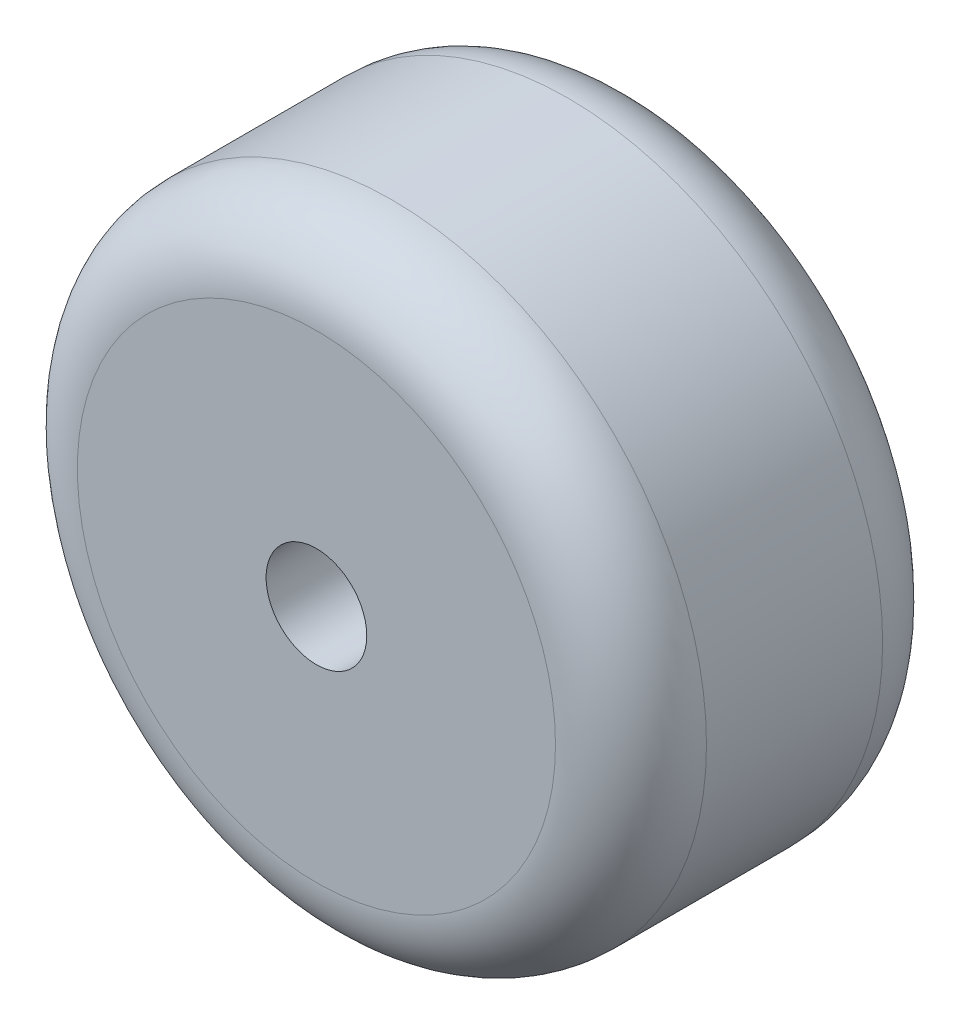
ISO-10303-21;
HEADER;
FILE_DESCRIPTION(('STEP AP214'),'2;1');
FILE_NAME('part.step','',(''),(''),'','','');
FILE_SCHEMA(('AUTOMOTIVE_DESIGN { 1 0 10303 214 1 1 1 1 }'));
ENDSEC;
DATA;
#1=APPLICATION_CONTEXT('core data for automotive mechanical design processes');
#2=APPLICATION_PROTOCOL_DEFINITION('international standard','automotive_design',2000,#1);
#3=PRODUCT_CONTEXT('',#1,'mechanical');
#4=PRODUCT('Part','Part','',(#3));
#5=PRODUCT_RELATED_PRODUCT_CATEGORY('part','',(#4));
#6=PRODUCT_DEFINITION_FORMATION('','',#4);
#7=PRODUCT_DEFINITION_CONTEXT('part definition',#1,'design');
#8=PRODUCT_DEFINITION('design','',#6,#7);
#9=PRODUCT_DEFINITION_SHAPE('','',#8);
#10=(LENGTH_UNIT() NAMED_UNIT(*) SI_UNIT(.MILLI.,.METRE.));
#11=(NAMED_UNIT(*) PLANE_ANGLE_UNIT() SI_UNIT($,.RADIAN.));
#12=(NAMED_UNIT(*) SI_UNIT($,.STERADIAN.) SOLID_ANGLE_UNIT());
#13=UNCERTAINTY_MEASURE_WITH_UNIT(LENGTH_MEASURE(1.E-05),#10,'distance_accuracy_value','');
#14=(GEOMETRIC_REPRESENTATION_CONTEXT(3) GLOBAL_UNCERTAINTY_ASSIGNED_CONTEXT((#13)) GLOBAL_UNIT_ASSIGNED_CONTEXT((#10,
#11,#12)) REPRESENTATION_CONTEXT('',''));
#15=CARTESIAN_POINT('',(0.,0.,0.));
#16=DIRECTION('',(0.,0.,1.));
#17=DIRECTION('',(1.,0.,0.));
#18=AXIS2_PLACEMENT_3D('',#15,#16,#17);
#19=CARTESIAN_POINT('',(0.,0.,6.50000000000001));
#20=DIRECTION('',(0.,0.,1.));
#21=DIRECTION('',(1.,0.,0.));
#22=AXIS2_PLACEMENT_3D('',#19,#20,#21);
#23=PLANE('',#22);
#24=CARTESIAN_POINT('',(0.,0.,6.50000000000001));
#25=DIRECTION('',(0.,0.,1.));
#26=DIRECTION('',(1.,0.,0.));
#27=AXIS2_PLACEMENT_3D('',#24,#25,#26);
#28=CIRCLE('',#27,2.);
#29=CARTESIAN_POINT('',(2.,0.,6.50000000000001));
#30=VERTEX_POINT('',#29);
#31=EDGE_CURVE('E50',#30,#30,#28,.T.);
#32=ORIENTED_EDGE('',*,*,#31,.F.);
#33=EDGE_LOOP('',(#32));
#34=FACE_BOUND('',#33,.T.);
#35=CARTESIAN_POINT('',(0.,0.,6.50000000000001));
#36=DIRECTION('',(0.,0.,1.));
#37=DIRECTION('',(1.,0.,0.));
#38=AXIS2_PLACEMENT_3D('',#35,#36,#37);
#39=CIRCLE('',#38,9.49999999999998);
#40=CARTESIAN_POINT('',(9.49999999999998,0.,6.50000000000001));
#41=VERTEX_POINT('',#40);
#42=EDGE_CURVE('E10',#41,#41,#39,.T.);
#43=ORIENTED_EDGE('',*,*,#42,.T.);
#44=EDGE_LOOP('',(#43));
#45=FACE_BOUND('',#44,.T.);
#46=ADVANCED_FACE('F31',(#34,#45),#23,.T.);
#47=CARTESIAN_POINT('',(0.,0.,3.50000000000001));
#48=DIRECTION('',(0.,0.,1.));
#49=DIRECTION('',(1.,0.,0.));
#50=AXIS2_PLACEMENT_3D('',#47,#48,#49);
#51=TOROIDAL_SURFACE('',#50,9.5,3.);
#52=CARTESIAN_POINT('',(0.,0.,3.49999999999998));
#53=DIRECTION('',(0.,0.,1.));
#54=DIRECTION('',(1.,0.,0.));
#55=AXIS2_PLACEMENT_3D('',#52,#53,#54);
#56=CIRCLE('',#55,12.5);
#57=CARTESIAN_POINT('',(12.5,0.,3.49999999999998));
#58=VERTEX_POINT('',#57);
#59=EDGE_CURVE('E37',#58,#58,#56,.T.);
#60=ORIENTED_EDGE('',*,*,#59,.T.);
#61=EDGE_LOOP('',(#60));
#62=FACE_BOUND('',#61,.T.);
#63=ORIENTED_EDGE('',*,*,#42,.F.);
#64=EDGE_LOOP('',(#63));
#65=FACE_BOUND('',#64,.T.);
#66=ADVANCED_FACE('F70',(#62,#65),#51,.T.);
#67=CARTESIAN_POINT('',(0.,0.,6.50000000000001));
#68=DIRECTION('',(0.,0.,1.));
#69=DIRECTION('',(1.,0.,0.));
#70=AXIS2_PLACEMENT_3D('',#67,#68,#69);
#71=CYLINDRICAL_SURFACE('',#70,12.5);
#72=CARTESIAN_POINT('',(0.,0.,-3.49999999999997));
#73=DIRECTION('',(0.,0.,1.));
#74=DIRECTION('',(1.,0.,0.));
#75=AXIS2_PLACEMENT_3D('',#72,#73,#74);
#76=CIRCLE('',#75,12.5);
#77=CARTESIAN_POINT('',(12.5,0.,-3.49999999999997));
#78=VERTEX_POINT('',#77);
#79=EDGE_CURVE('E41',#78,#78,#76,.T.);
#80=ORIENTED_EDGE('',*,*,#79,.T.);
#81=EDGE_LOOP('',(#80));
#82=FACE_BOUND('',#81,.T.);
#83=ORIENTED_EDGE('',*,*,#59,.F.);
#84=EDGE_LOOP('',(#83));
#85=FACE_BOUND('',#84,.T.);
#86=ADVANCED_FACE('F75',(#82,#85),#71,.T.);
#87=CARTESIAN_POINT('',(0.,0.,-3.49999999999999));
#88=DIRECTION('',(0.,0.,1.));
#89=DIRECTION('',(1.,0.,0.));
#90=AXIS2_PLACEMENT_3D('',#87,#88,#89);
#91=TOROIDAL_SURFACE('',#90,9.5,3.);
#92=CARTESIAN_POINT('',(0.,0.,-6.49999999999999));
#93=DIRECTION('',(0.,0.,1.));
#94=DIRECTION('',(1.,0.,0.));
#95=AXIS2_PLACEMENT_3D('',#92,#93,#94);
#96=CIRCLE('',#95,9.49999999999998);
#97=CARTESIAN_POINT('',(9.49999999999998,0.,-6.49999999999999));
#98=VERTEX_POINT('',#97);
#99=EDGE_CURVE('E45',#98,#98,#96,.T.);
#100=ORIENTED_EDGE('',*,*,#99,.T.);
#101=EDGE_LOOP('',(#100));
#102=FACE_BOUND('',#101,.T.);
#103=ORIENTED_EDGE('',*,*,#79,.F.);
#104=EDGE_LOOP('',(#103));
#105=FACE_BOUND('',#104,.T.);
#106=ADVANCED_FACE('F67',(#102,#105),#91,.T.);
#107=CARTESIAN_POINT('',(0.,0.,-6.49999999999999));
#108=DIRECTION('',(0.,0.,-1.));
#109=DIRECTION('',(-1.,0.,0.));
#110=AXIS2_PLACEMENT_3D('',#107,#108,#109);
#111=PLANE('',#110);
#112=CARTESIAN_POINT('',(0.,0.,-6.49999999999999));
#113=DIRECTION('',(0.,0.,1.));
#114=DIRECTION('',(1.,0.,0.));
#115=AXIS2_PLACEMENT_3D('',#112,#113,#114);
#116=CIRCLE('',#115,2.);
#117=CARTESIAN_POINT('',(2.,0.,-6.49999999999999));
#118=VERTEX_POINT('',#117);
#119=EDGE_CURVE('E53',#118,#118,#116,.T.);
#120=ORIENTED_EDGE('',*,*,#119,.T.);
#121=EDGE_LOOP('',(#120));
#122=FACE_BOUND('',#121,.T.);
#123=ORIENTED_EDGE('',*,*,#99,.F.);
#124=EDGE_LOOP('',(#123));
#125=FACE_BOUND('',#124,.T.);
#126=ADVANCED_FACE('F57',(#122,#125),#111,.T.);
#127=CARTESIAN_POINT('',(0.,0.,-6.49999999999999));
#128=DIRECTION('',(0.,0.,1.));
#129=DIRECTION('',(1.,0.,0.));
#130=AXIS2_PLACEMENT_3D('',#127,#128,#129);
#131=CYLINDRICAL_SURFACE('',#130,2.);
#132=ORIENTED_EDGE('',*,*,#31,.T.);
#133=EDGE_LOOP('',(#132));
#134=FACE_BOUND('',#133,.T.);
#135=ORIENTED_EDGE('',*,*,#119,.F.);
#136=EDGE_LOOP('',(#135));
#137=FACE_BOUND('',#136,.T.);
#138=ADVANCED_FACE('F60',(#134,#137),#131,.F.);
#139=CLOSED_SHELL('',(#46,#66,#86,#106,#126,#138));
#140=MANIFOLD_SOLID_BREP('B2',#139);
#141=ADVANCED_BREP_SHAPE_REPRESENTATION('',(#18,#140),#14);
#142=SHAPE_DEFINITION_REPRESENTATION(#9,#141);
ENDSEC;
END-ISO-10303-21;
